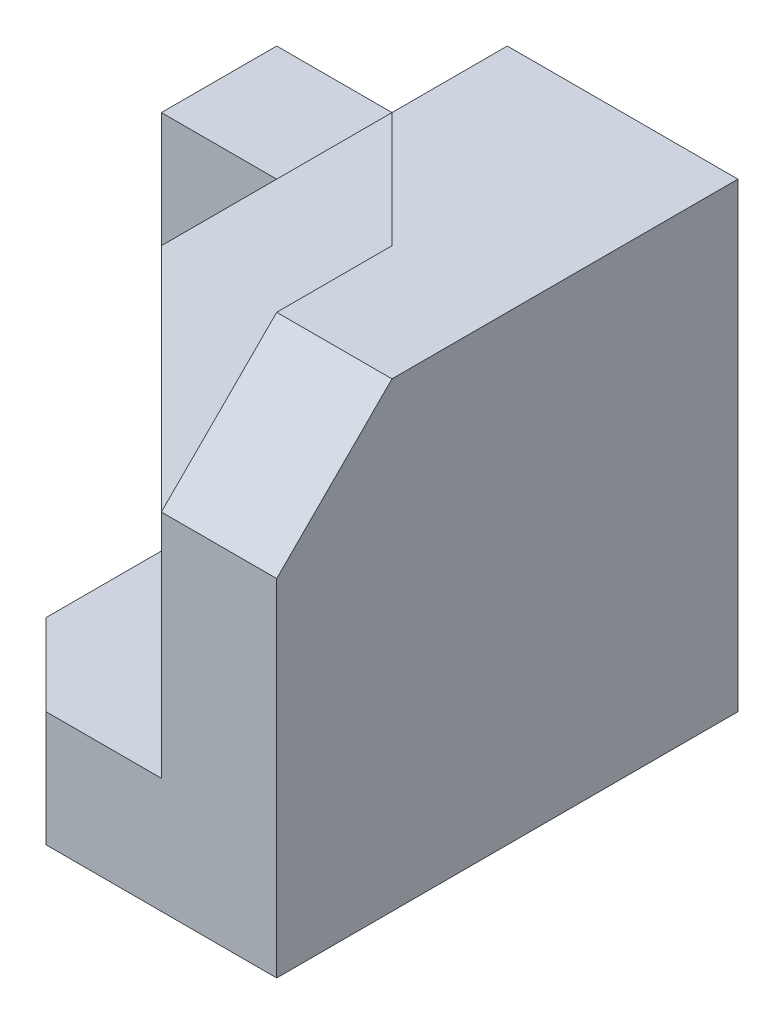
ISO-10303-21;
HEADER;
FILE_DESCRIPTION(('STEP AP214'),'2;1');
FILE_NAME('part.step','',(''),(''),'','','');
FILE_SCHEMA(('AUTOMOTIVE_DESIGN { 1 0 10303 214 1 1 1 1 }'));
ENDSEC;
DATA;
#1=APPLICATION_CONTEXT('core data for automotive mechanical design processes');
#2=APPLICATION_PROTOCOL_DEFINITION('international standard','automotive_design',2000,#1);
#3=PRODUCT_CONTEXT('',#1,'mechanical');
#4=PRODUCT('Part','Part','',(#3));
#5=PRODUCT_RELATED_PRODUCT_CATEGORY('part','',(#4));
#6=PRODUCT_DEFINITION_FORMATION('','',#4);
#7=PRODUCT_DEFINITION_CONTEXT('part definition',#1,'design');
#8=PRODUCT_DEFINITION('design','',#6,#7);
#9=PRODUCT_DEFINITION_SHAPE('','',#8);
#10=(LENGTH_UNIT() NAMED_UNIT(*) SI_UNIT(.MILLI.,.METRE.));
#11=(NAMED_UNIT(*) PLANE_ANGLE_UNIT() SI_UNIT($,.RADIAN.));
#12=(NAMED_UNIT(*) SI_UNIT($,.STERADIAN.) SOLID_ANGLE_UNIT());
#13=UNCERTAINTY_MEASURE_WITH_UNIT(LENGTH_MEASURE(1.E-05),#10,'distance_accuracy_value','');
#14=(GEOMETRIC_REPRESENTATION_CONTEXT(3) GLOBAL_UNCERTAINTY_ASSIGNED_CONTEXT((#13)) GLOBAL_UNIT_ASSIGNED_CONTEXT((#10,
#11,#12)) REPRESENTATION_CONTEXT('',''));
#15=CARTESIAN_POINT('',(0.,0.,0.));
#16=DIRECTION('',(0.,0.,1.));
#17=DIRECTION('',(1.,0.,0.));
#18=AXIS2_PLACEMENT_3D('',#15,#16,#17);
#19=CARTESIAN_POINT('',(0.,20.,0.));
#20=DIRECTION('',(0.,-1.,0.));
#21=DIRECTION('',(0.,0.,-1.));
#22=AXIS2_PLACEMENT_3D('',#19,#20,#21);
#23=PLANE('',#22);
#24=DIRECTION('',(0.,0.,-1.));
#25=VECTOR('',#24,1.);
#26=CARTESIAN_POINT('',(5.00000000000001,20.,0.));
#27=LINE('',#26,#25);
#28=CARTESIAN_POINT('',(5.,20.,15.));
#29=VERTEX_POINT('',#28);
#30=CARTESIAN_POINT('',(5.,20.,10.));
#31=VERTEX_POINT('',#30);
#32=EDGE_CURVE('E288',#29,#31,#27,.T.);
#33=ORIENTED_EDGE('',*,*,#32,.F.);
#34=DIRECTION('',(-1.,0.,0.));
#35=VECTOR('',#34,1.);
#36=CARTESIAN_POINT('',(10.,20.,15.));
#37=LINE('',#36,#35);
#38=CARTESIAN_POINT('',(10.,20.,15.));
#39=VERTEX_POINT('',#38);
#40=EDGE_CURVE('E202',#39,#29,#37,.T.);
#41=ORIENTED_EDGE('',*,*,#40,.F.);
#42=DIRECTION('',(0.,0.,-1.));
#43=VECTOR('',#42,1.);
#44=CARTESIAN_POINT('',(10.,20.,0.));
#45=LINE('',#44,#43);
#46=CARTESIAN_POINT('',(10.,20.,0.));
#47=VERTEX_POINT('',#46);
#48=EDGE_CURVE('E219',#39,#47,#45,.T.);
#49=ORIENTED_EDGE('',*,*,#48,.T.);
#50=DIRECTION('',(-1.,0.,0.));
#51=VECTOR('',#50,1.);
#52=CARTESIAN_POINT('',(0.,20.,0.));
#53=LINE('',#52,#51);
#54=CARTESIAN_POINT('',(0.,20.,0.));
#55=VERTEX_POINT('',#54);
#56=EDGE_CURVE('E43',#47,#55,#53,.T.);
#57=ORIENTED_EDGE('',*,*,#56,.T.);
#58=DIRECTION('',(0.,0.,1.));
#59=VECTOR('',#58,1.);
#60=CARTESIAN_POINT('',(0.,20.,0.));
#61=LINE('',#60,#59);
#62=CARTESIAN_POINT('',(0.,20.,5.));
#63=VERTEX_POINT('',#62);
#64=EDGE_CURVE('E195',#55,#63,#61,.T.);
#65=ORIENTED_EDGE('',*,*,#64,.T.);
#66=DIRECTION('',(0.707106781186547,0.,0.707106781186548));
#67=VECTOR('',#66,1.);
#68=CARTESIAN_POINT('',(0.,20.,5.));
#69=LINE('',#68,#67);
#70=EDGE_CURVE('E289',#63,#31,#69,.T.);
#71=ORIENTED_EDGE('',*,*,#70,.T.);
#72=EDGE_LOOP('',(#33,#41,#49,#57,#65,#71));
#73=FACE_BOUND('',#72,.T.);
#74=ADVANCED_FACE('F34',(#73),#23,.F.);
#75=CARTESIAN_POINT('',(0.,20.,15.));
#76=DIRECTION('',(-0.707106781186548,0.,0.707106781186548));
#77=DIRECTION('',(0.707106781186548,0.,0.707106781186548));
#78=AXIS2_PLACEMENT_3D('',#75,#76,#77);
#79=PLANE('',#78);
#80=DIRECTION('',(0.,-1.,0.));
#81=VECTOR('',#80,1.);
#82=CARTESIAN_POINT('',(-3.53553390593274,5.,11.4644660940673));
#83=LINE('',#82,#81);
#84=CARTESIAN_POINT('',(-3.53553390593274,5.,11.4644660940673));
#85=VERTEX_POINT('',#84);
#86=CARTESIAN_POINT('',(-3.53553390593274,0.,11.4644660940673));
#87=VERTEX_POINT('',#86);
#88=EDGE_CURVE('E157',#85,#87,#83,.T.);
#89=ORIENTED_EDGE('',*,*,#88,.F.);
#90=DIRECTION('',(0.707106781186548,0.,0.707106781186547));
#91=VECTOR('',#90,1.);
#92=CARTESIAN_POINT('',(-3.53553390593274,5.,11.4644660940673));
#93=LINE('',#92,#91);
#94=CARTESIAN_POINT('',(0.,5.,15.));
#95=VERTEX_POINT('',#94);
#96=EDGE_CURVE('E142',#85,#95,#93,.T.);
#97=ORIENTED_EDGE('',*,*,#96,.T.);
#98=DIRECTION('',(0.,-1.,0.));
#99=VECTOR('',#98,1.);
#100=CARTESIAN_POINT('',(0.,20.,15.));
#101=LINE('',#100,#99);
#102=CARTESIAN_POINT('',(0.,10.,15.));
#103=VERTEX_POINT('',#102);
#104=EDGE_CURVE('E155',#103,#95,#101,.T.);
#105=ORIENTED_EDGE('',*,*,#104,.F.);
#106=DIRECTION('',(-0.707106781186548,0.,-0.707106781186548));
#107=VECTOR('',#106,1.);
#108=CARTESIAN_POINT('',(0.,10.,15.));
#109=LINE('',#108,#107);
#110=CARTESIAN_POINT('',(-10.,10.,5.));
#111=VERTEX_POINT('',#110);
#112=EDGE_CURVE('E277',#103,#111,#109,.T.);
#113=ORIENTED_EDGE('',*,*,#112,.T.);
#114=DIRECTION('',(0.,1.,0.));
#115=VECTOR('',#114,1.);
#116=CARTESIAN_POINT('',(-10.,0.,5.));
#117=LINE('',#116,#115);
#118=CARTESIAN_POINT('',(-10.,0.,5.));
#119=VERTEX_POINT('',#118);
#120=EDGE_CURVE('E174',#119,#111,#117,.T.);
#121=ORIENTED_EDGE('',*,*,#120,.F.);
#122=DIRECTION('',(-0.707106781186548,0.,-0.707106781186548));
#123=VECTOR('',#122,1.);
#124=CARTESIAN_POINT('',(0.,0.,15.));
#125=LINE('',#124,#123);
#126=EDGE_CURVE('E169',#87,#119,#125,.T.);
#127=ORIENTED_EDGE('',*,*,#126,.F.);
#128=EDGE_LOOP('',(#89,#97,#105,#113,#121,#127));
#129=FACE_BOUND('',#128,.T.);
#130=ADVANCED_FACE('F153',(#129),#79,.T.);
#131=CARTESIAN_POINT('',(5.,20.,15.));
#132=DIRECTION('',(0.,0.,1.));
#133=DIRECTION('',(1.,0.,0.));
#134=AXIS2_PLACEMENT_3D('',#131,#132,#133);
#135=PLANE('',#134);
#136=DIRECTION('',(1.,0.,0.));
#137=VECTOR('',#136,1.);
#138=CARTESIAN_POINT('',(0.,5.,15.));
#139=LINE('',#138,#137);
#140=CARTESIAN_POINT('',(5.,5.,15.));
#141=VERTEX_POINT('',#140);
#142=EDGE_CURVE('E138',#95,#141,#139,.T.);
#143=ORIENTED_EDGE('',*,*,#142,.T.);
#144=DIRECTION('',(0.,-1.,0.));
#145=VECTOR('',#144,1.);
#146=CARTESIAN_POINT('',(5.,20.,15.));
#147=LINE('',#146,#145);
#148=CARTESIAN_POINT('',(5.,15.,15.));
#149=VERTEX_POINT('',#148);
#150=EDGE_CURVE('E164',#149,#141,#147,.T.);
#151=ORIENTED_EDGE('',*,*,#150,.F.);
#152=DIRECTION('',(-0.707106781186548,-0.707106781186547,0.));
#153=VECTOR('',#152,1.);
#154=CARTESIAN_POINT('',(5.,15.,15.));
#155=LINE('',#154,#153);
#156=EDGE_CURVE('E162',#149,#103,#155,.T.);
#157=ORIENTED_EDGE('',*,*,#156,.T.);
#158=ORIENTED_EDGE('',*,*,#104,.T.);
#159=EDGE_LOOP('',(#143,#151,#157,#158));
#160=FACE_BOUND('',#159,.T.);
#161=ADVANCED_FACE('F161',(#160),#135,.T.);
#162=CARTESIAN_POINT('',(5.,20.,15.));
#163=DIRECTION('',(1.,0.,0.));
#164=DIRECTION('',(0.,0.,-1.));
#165=AXIS2_PLACEMENT_3D('',#162,#163,#164);
#166=PLANE('',#165);
#167=ORIENTED_EDGE('',*,*,#150,.T.);
#168=DIRECTION('',(0.,0.,1.));
#169=VECTOR('',#168,1.);
#170=CARTESIAN_POINT('',(5.,5.,15.));
#171=LINE('',#170,#169);
#172=CARTESIAN_POINT('',(5.,5.,20.));
#173=VERTEX_POINT('',#172);
#174=EDGE_CURVE('E145',#141,#173,#171,.T.);
#175=ORIENTED_EDGE('',*,*,#174,.T.);
#176=DIRECTION('',(0.,-1.,0.));
#177=VECTOR('',#176,1.);
#178=CARTESIAN_POINT('',(5.,0.,20.));
#179=LINE('',#178,#177);
#180=CARTESIAN_POINT('',(5.,15.,20.));
#181=VERTEX_POINT('',#180);
#182=EDGE_CURVE('E207',#181,#173,#179,.T.);
#183=ORIENTED_EDGE('',*,*,#182,.F.);
#184=DIRECTION('',(0.,-0.707106781186548,0.707106781186548));
#185=VECTOR('',#184,1.);
#186=CARTESIAN_POINT('',(5.,20.,15.));
#187=LINE('',#186,#185);
#188=EDGE_CURVE('E198',#29,#181,#187,.T.);
#189=ORIENTED_EDGE('',*,*,#188,.F.);
#190=ORIENTED_EDGE('',*,*,#32,.T.);
#191=DIRECTION('',(0.,-0.707106781186548,0.707106781186547));
#192=VECTOR('',#191,1.);
#193=CARTESIAN_POINT('',(5.,20.,10.));
#194=LINE('',#193,#192);
#195=EDGE_CURVE('E51',#31,#149,#194,.T.);
#196=ORIENTED_EDGE('',*,*,#195,.T.);
#197=EDGE_LOOP('',(#167,#175,#183,#189,#190,#196));
#198=FACE_BOUND('',#197,.T.);
#199=ADVANCED_FACE('F36',(#198),#166,.F.);
#200=CARTESIAN_POINT('',(10.,20.,0.));
#201=DIRECTION('',(-1.,0.,0.));
#202=DIRECTION('',(0.,0.,1.));
#203=AXIS2_PLACEMENT_3D('',#200,#201,#202);
#204=PLANE('',#203);
#205=ORIENTED_EDGE('',*,*,#48,.F.);
#206=DIRECTION('',(0.,-0.707106781186548,0.707106781186548));
#207=VECTOR('',#206,1.);
#208=CARTESIAN_POINT('',(10.,20.,15.));
#209=LINE('',#208,#207);
#210=CARTESIAN_POINT('',(10.,15.,20.));
#211=VERTEX_POINT('',#210);
#212=EDGE_CURVE('E199',#39,#211,#209,.T.);
#213=ORIENTED_EDGE('',*,*,#212,.T.);
#214=DIRECTION('',(0.,1.,0.));
#215=VECTOR('',#214,1.);
#216=CARTESIAN_POINT('',(10.,0.,20.));
#217=LINE('',#216,#215);
#218=CARTESIAN_POINT('',(10.,0.,20.));
#219=VERTEX_POINT('',#218);
#220=EDGE_CURVE('E215',#219,#211,#217,.T.);
#221=ORIENTED_EDGE('',*,*,#220,.F.);
#222=DIRECTION('',(0.,0.,-1.));
#223=VECTOR('',#222,1.);
#224=CARTESIAN_POINT('',(10.,0.,0.));
#225=LINE('',#224,#223);
#226=CARTESIAN_POINT('',(10.,0.,0.));
#227=VERTEX_POINT('',#226);
#228=EDGE_CURVE('E218',#219,#227,#225,.T.);
#229=ORIENTED_EDGE('',*,*,#228,.T.);
#230=DIRECTION('',(0.,-1.,0.));
#231=VECTOR('',#230,1.);
#232=CARTESIAN_POINT('',(10.,20.,0.));
#233=LINE('',#232,#231);
#234=EDGE_CURVE('E12',#47,#227,#233,.T.);
#235=ORIENTED_EDGE('',*,*,#234,.F.);
#236=EDGE_LOOP('',(#205,#213,#221,#229,#235));
#237=FACE_BOUND('',#236,.T.);
#238=ADVANCED_FACE('F252',(#237),#204,.F.);
#239=CARTESIAN_POINT('',(0.,20.,0.));
#240=DIRECTION('',(0.,0.,1.));
#241=DIRECTION('',(1.,0.,0.));
#242=AXIS2_PLACEMENT_3D('',#239,#240,#241);
#243=PLANE('',#242);
#244=DIRECTION('',(-1.,0.,0.));
#245=VECTOR('',#244,1.);
#246=CARTESIAN_POINT('',(0.,0.,0.));
#247=LINE('',#246,#245);
#248=CARTESIAN_POINT('',(-10.,0.,0.));
#249=VERTEX_POINT('',#248);
#250=EDGE_CURVE('E221',#227,#249,#247,.T.);
#251=ORIENTED_EDGE('',*,*,#250,.T.);
#252=DIRECTION('',(0.,-1.,0.));
#253=VECTOR('',#252,1.);
#254=CARTESIAN_POINT('',(-10.,0.,0.));
#255=LINE('',#254,#253);
#256=CARTESIAN_POINT('',(-10.,15.,0.));
#257=VERTEX_POINT('',#256);
#258=EDGE_CURVE('E163',#257,#249,#255,.T.);
#259=ORIENTED_EDGE('',*,*,#258,.F.);
#260=DIRECTION('',(1.,0.,0.));
#261=VECTOR('',#260,1.);
#262=CARTESIAN_POINT('',(-10.,15.,0.));
#263=LINE('',#262,#261);
#264=CARTESIAN_POINT('',(-5.,15.,0.));
#265=VERTEX_POINT('',#264);
#266=EDGE_CURVE('E187',#257,#265,#263,.T.);
#267=ORIENTED_EDGE('',*,*,#266,.T.);
#268=DIRECTION('',(0.707106781186547,0.707106781186548,0.));
#269=VECTOR('',#268,1.);
#270=CARTESIAN_POINT('',(-5.,15.,0.));
#271=LINE('',#270,#269);
#272=EDGE_CURVE('E59',#265,#55,#271,.T.);
#273=ORIENTED_EDGE('',*,*,#272,.T.);
#274=ORIENTED_EDGE('',*,*,#56,.F.);
#275=ORIENTED_EDGE('',*,*,#234,.T.);
#276=EDGE_LOOP('',(#251,#259,#267,#273,#274,#275));
#277=FACE_BOUND('',#276,.T.);
#278=ADVANCED_FACE('F229',(#277),#243,.F.);
#279=CARTESIAN_POINT('',(0.,0.,0.));
#280=DIRECTION('',(0.,-1.,0.));
#281=DIRECTION('',(0.,0.,-1.));
#282=AXIS2_PLACEMENT_3D('',#279,#280,#281);
#283=PLANE('',#282);
#284=DIRECTION('',(0.,0.,-1.));
#285=VECTOR('',#284,1.);
#286=CARTESIAN_POINT('',(-3.53553390593274,0.,16.4644660940673));
#287=LINE('',#286,#285);
#288=CARTESIAN_POINT('',(-3.53553390593274,0.,16.4644660940673));
#289=VERTEX_POINT('',#288);
#290=EDGE_CURVE('E158',#289,#87,#287,.T.);
#291=ORIENTED_EDGE('',*,*,#290,.T.);
#292=ORIENTED_EDGE('',*,*,#126,.T.);
#293=DIRECTION('',(0.,0.,1.));
#294=VECTOR('',#293,1.);
#295=CARTESIAN_POINT('',(-10.,0.,0.));
#296=LINE('',#295,#294);
#297=EDGE_CURVE('E167',#249,#119,#296,.T.);
#298=ORIENTED_EDGE('',*,*,#297,.F.);
#299=ORIENTED_EDGE('',*,*,#250,.F.);
#300=ORIENTED_EDGE('',*,*,#228,.F.);
#301=DIRECTION('',(1.,0.,0.));
#302=VECTOR('',#301,1.);
#303=CARTESIAN_POINT('',(5.,0.,20.));
#304=LINE('',#303,#302);
#305=CARTESIAN_POINT('',(0.,0.,20.));
#306=VERTEX_POINT('',#305);
#307=EDGE_CURVE('E212',#306,#219,#304,.T.);
#308=ORIENTED_EDGE('',*,*,#307,.F.);
#309=DIRECTION('',(-0.707106781186548,0.,-0.707106781186547));
#310=VECTOR('',#309,1.);
#311=CARTESIAN_POINT('',(0.,0.,20.));
#312=LINE('',#311,#310);
#313=EDGE_CURVE('E268',#306,#289,#312,.T.);
#314=ORIENTED_EDGE('',*,*,#313,.T.);
#315=EDGE_LOOP('',(#291,#292,#298,#299,#300,#308,#314));
#316=FACE_BOUND('',#315,.T.);
#317=ADVANCED_FACE('F234',(#316),#283,.T.);
#318=CARTESIAN_POINT('',(0.,0.,20.));
#319=DIRECTION('',(0.,0.,-1.));
#320=DIRECTION('',(-1.,0.,0.));
#321=AXIS2_PLACEMENT_3D('',#318,#319,#320);
#322=PLANE('',#321);
#323=ORIENTED_EDGE('',*,*,#220,.T.);
#324=DIRECTION('',(-1.,0.,0.));
#325=VECTOR('',#324,1.);
#326=CARTESIAN_POINT('',(10.,15.,20.));
#327=LINE('',#326,#325);
#328=EDGE_CURVE('E204',#211,#181,#327,.T.);
#329=ORIENTED_EDGE('',*,*,#328,.T.);
#330=ORIENTED_EDGE('',*,*,#182,.T.);
#331=DIRECTION('',(-1.,0.,0.));
#332=VECTOR('',#331,1.);
#333=CARTESIAN_POINT('',(5.,5.,20.));
#334=LINE('',#333,#332);
#335=CARTESIAN_POINT('',(0.,5.,20.));
#336=VERTEX_POINT('',#335);
#337=EDGE_CURVE('E261',#173,#336,#334,.T.);
#338=ORIENTED_EDGE('',*,*,#337,.T.);
#339=DIRECTION('',(0.,-1.,0.));
#340=VECTOR('',#339,1.);
#341=CARTESIAN_POINT('',(0.,5.,20.));
#342=LINE('',#341,#340);
#343=EDGE_CURVE('E259',#336,#306,#342,.T.);
#344=ORIENTED_EDGE('',*,*,#343,.T.);
#345=ORIENTED_EDGE('',*,*,#307,.T.);
#346=EDGE_LOOP('',(#323,#329,#330,#338,#344,#345));
#347=FACE_BOUND('',#346,.T.);
#348=ADVANCED_FACE('F257',(#347),#322,.F.);
#349=CARTESIAN_POINT('',(10.,20.,15.));
#350=DIRECTION('',(0.,-0.707106781186548,-0.707106781186548));
#351=DIRECTION('',(0.,0.707106781186548,-0.707106781186548));
#352=AXIS2_PLACEMENT_3D('',#349,#350,#351);
#353=PLANE('',#352);
#354=ORIENTED_EDGE('',*,*,#188,.T.);
#355=ORIENTED_EDGE('',*,*,#328,.F.);
#356=ORIENTED_EDGE('',*,*,#212,.F.);
#357=ORIENTED_EDGE('',*,*,#40,.T.);
#358=EDGE_LOOP('',(#354,#355,#356,#357));
#359=FACE_BOUND('',#358,.T.);
#360=ADVANCED_FACE('F309',(#359),#353,.F.);
#361=CARTESIAN_POINT('',(-5.,15.,0.));
#362=DIRECTION('',(0.707106781186548,-0.707106781186547,0.));
#363=DIRECTION('',(0.707106781186547,0.707106781186548,0.));
#364=AXIS2_PLACEMENT_3D('',#361,#362,#363);
#365=PLANE('',#364);
#366=DIRECTION('',(0.707106781186547,0.707106781186548,0.));
#367=VECTOR('',#366,1.);
#368=CARTESIAN_POINT('',(-5.,15.,5.));
#369=LINE('',#368,#367);
#370=CARTESIAN_POINT('',(-5.00000000000001,15.,5.));
#371=VERTEX_POINT('',#370);
#372=EDGE_CURVE('E193',#371,#63,#369,.T.);
#373=ORIENTED_EDGE('',*,*,#372,.T.);
#374=ORIENTED_EDGE('',*,*,#64,.F.);
#375=ORIENTED_EDGE('',*,*,#272,.F.);
#376=DIRECTION('',(0.,0.,1.));
#377=VECTOR('',#376,1.);
#378=CARTESIAN_POINT('',(-5.,15.,0.));
#379=LINE('',#378,#377);
#380=EDGE_CURVE('E196',#265,#371,#379,.T.);
#381=ORIENTED_EDGE('',*,*,#380,.T.);
#382=EDGE_LOOP('',(#373,#374,#375,#381));
#383=FACE_BOUND('',#382,.T.);
#384=ADVANCED_FACE('F311',(#383),#365,.F.);
#385=CARTESIAN_POINT('',(-10.,15.,0.));
#386=DIRECTION('',(0.,-1.,0.));
#387=DIRECTION('',(0.,0.,-1.));
#388=AXIS2_PLACEMENT_3D('',#385,#386,#387);
#389=PLANE('',#388);
#390=ORIENTED_EDGE('',*,*,#380,.F.);
#391=ORIENTED_EDGE('',*,*,#266,.F.);
#392=DIRECTION('',(0.,0.,-1.));
#393=VECTOR('',#392,1.);
#394=CARTESIAN_POINT('',(-10.,15.,0.));
#395=LINE('',#394,#393);
#396=CARTESIAN_POINT('',(-10.,15.,5.));
#397=VERTEX_POINT('',#396);
#398=EDGE_CURVE('E185',#397,#257,#395,.T.);
#399=ORIENTED_EDGE('',*,*,#398,.F.);
#400=DIRECTION('',(1.,0.,0.));
#401=VECTOR('',#400,1.);
#402=CARTESIAN_POINT('',(-10.,15.,5.));
#403=LINE('',#402,#401);
#404=EDGE_CURVE('E190',#397,#371,#403,.T.);
#405=ORIENTED_EDGE('',*,*,#404,.T.);
#406=EDGE_LOOP('',(#390,#391,#399,#405));
#407=FACE_BOUND('',#406,.T.);
#408=ADVANCED_FACE('F245',(#407),#389,.F.);
#409=CARTESIAN_POINT('',(-10.,0.,0.));
#410=DIRECTION('',(1.,0.,0.));
#411=DIRECTION('',(0.,0.,-1.));
#412=AXIS2_PLACEMENT_3D('',#409,#410,#411);
#413=PLANE('',#412);
#414=ORIENTED_EDGE('',*,*,#258,.T.);
#415=ORIENTED_EDGE('',*,*,#297,.T.);
#416=ORIENTED_EDGE('',*,*,#120,.T.);
#417=DIRECTION('',(0.,1.,0.));
#418=VECTOR('',#417,1.);
#419=CARTESIAN_POINT('',(-10.,10.,5.));
#420=LINE('',#419,#418);
#421=EDGE_CURVE('E243',#111,#397,#420,.T.);
#422=ORIENTED_EDGE('',*,*,#421,.T.);
#423=ORIENTED_EDGE('',*,*,#398,.T.);
#424=EDGE_LOOP('',(#414,#415,#416,#422,#423));
#425=FACE_BOUND('',#424,.T.);
#426=ADVANCED_FACE('F238',(#425),#413,.F.);
#427=CARTESIAN_POINT('',(-10.,10.,5.));
#428=DIRECTION('',(0.,0.,1.));
#429=DIRECTION('',(1.,0.,0.));
#430=AXIS2_PLACEMENT_3D('',#427,#428,#429);
#431=PLANE('',#430);
#432=ORIENTED_EDGE('',*,*,#404,.F.);
#433=ORIENTED_EDGE('',*,*,#421,.F.);
#434=DIRECTION('',(0.707106781186547,0.707106781186548,0.));
#435=VECTOR('',#434,1.);
#436=CARTESIAN_POINT('',(-10.,10.,5.));
#437=LINE('',#436,#435);
#438=EDGE_CURVE('E285',#111,#371,#437,.T.);
#439=ORIENTED_EDGE('',*,*,#438,.T.);
#440=EDGE_LOOP('',(#432,#433,#439));
#441=FACE_BOUND('',#440,.T.);
#442=ADVANCED_FACE('F344',(#441),#431,.T.);
#443=CARTESIAN_POINT('',(-8.33333333333333,8.33333333333333,8.33333333333334));
#444=DIRECTION('',(-0.577350269189626,0.577350269189626,0.577350269189626));
#445=DIRECTION('',(0.,-0.707106781186548,0.707106781186547));
#446=AXIS2_PLACEMENT_3D('',#443,#444,#445);
#447=PLANE('',#446);
#448=ORIENTED_EDGE('',*,*,#438,.F.);
#449=ORIENTED_EDGE('',*,*,#112,.F.);
#450=ORIENTED_EDGE('',*,*,#156,.F.);
#451=ORIENTED_EDGE('',*,*,#195,.F.);
#452=ORIENTED_EDGE('',*,*,#70,.F.);
#453=ORIENTED_EDGE('',*,*,#372,.F.);
#454=EDGE_LOOP('',(#448,#449,#450,#451,#452,#453));
#455=FACE_BOUND('',#454,.T.);
#456=ADVANCED_FACE('F305',(#455),#447,.T.);
#457=CARTESIAN_POINT('',(-3.53553390593274,5.,16.4644660940673));
#458=DIRECTION('',(-1.,0.,0.));
#459=DIRECTION('',(0.,0.,1.));
#460=AXIS2_PLACEMENT_3D('',#457,#458,#459);
#461=PLANE('',#460);
#462=ORIENTED_EDGE('',*,*,#290,.F.);
#463=DIRECTION('',(0.,-1.,0.));
#464=VECTOR('',#463,1.);
#465=CARTESIAN_POINT('',(-3.53553390593274,5.,16.4644660940673));
#466=LINE('',#465,#464);
#467=CARTESIAN_POINT('',(-3.53553390593274,5.,16.4644660940673));
#468=VERTEX_POINT('',#467);
#469=EDGE_CURVE('E265',#468,#289,#466,.T.);
#470=ORIENTED_EDGE('',*,*,#469,.F.);
#471=DIRECTION('',(0.,0.,-1.));
#472=VECTOR('',#471,1.);
#473=CARTESIAN_POINT('',(-3.53553390593274,5.,16.4644660940673));
#474=LINE('',#473,#472);
#475=EDGE_CURVE('E266',#468,#85,#474,.T.);
#476=ORIENTED_EDGE('',*,*,#475,.T.);
#477=ORIENTED_EDGE('',*,*,#88,.T.);
#478=EDGE_LOOP('',(#462,#470,#476,#477));
#479=FACE_BOUND('',#478,.T.);
#480=ADVANCED_FACE('F366',(#479),#461,.T.);
#481=CARTESIAN_POINT('',(0.,5.,20.));
#482=DIRECTION('',(-0.707106781186547,0.,0.707106781186548));
#483=DIRECTION('',(0.707106781186548,0.,0.707106781186547));
#484=AXIS2_PLACEMENT_3D('',#481,#482,#483);
#485=PLANE('',#484);
#486=ORIENTED_EDGE('',*,*,#313,.F.);
#487=ORIENTED_EDGE('',*,*,#343,.F.);
#488=DIRECTION('',(-0.707106781186548,0.,-0.707106781186547));
#489=VECTOR('',#488,1.);
#490=CARTESIAN_POINT('',(0.,5.,20.));
#491=LINE('',#490,#489);
#492=EDGE_CURVE('E491',#336,#468,#491,.T.);
#493=ORIENTED_EDGE('',*,*,#492,.T.);
#494=ORIENTED_EDGE('',*,*,#469,.T.);
#495=EDGE_LOOP('',(#486,#487,#493,#494));
#496=FACE_BOUND('',#495,.T.);
#497=ADVANCED_FACE('F269',(#496),#485,.T.);
#498=CARTESIAN_POINT('',(0.,5.,0.));
#499=DIRECTION('',(0.,1.,0.));
#500=DIRECTION('',(0.,0.,1.));
#501=AXIS2_PLACEMENT_3D('',#498,#499,#500);
#502=PLANE('',#501);
#503=ORIENTED_EDGE('',*,*,#96,.F.);
#504=ORIENTED_EDGE('',*,*,#475,.F.);
#505=ORIENTED_EDGE('',*,*,#492,.F.);
#506=ORIENTED_EDGE('',*,*,#337,.F.);
#507=ORIENTED_EDGE('',*,*,#174,.F.);
#508=ORIENTED_EDGE('',*,*,#142,.F.);
#509=EDGE_LOOP('',(#503,#504,#505,#506,#507,#508));
#510=FACE_BOUND('',#509,.T.);
#511=ADVANCED_FACE('F140',(#510),#502,.T.);
#512=CLOSED_SHELL('',(#74,#130,#161,#199,#238,#278,#317,#348,#360,#384,#408,#426,#442,#456,#480,
#497,#511));
#513=MANIFOLD_SOLID_BREP('B2',#512);
#514=ADVANCED_BREP_SHAPE_REPRESENTATION('',(#18,#513),#14);
#515=SHAPE_DEFINITION_REPRESENTATION(#9,#514);
ENDSEC;
END-ISO-10303-21;
